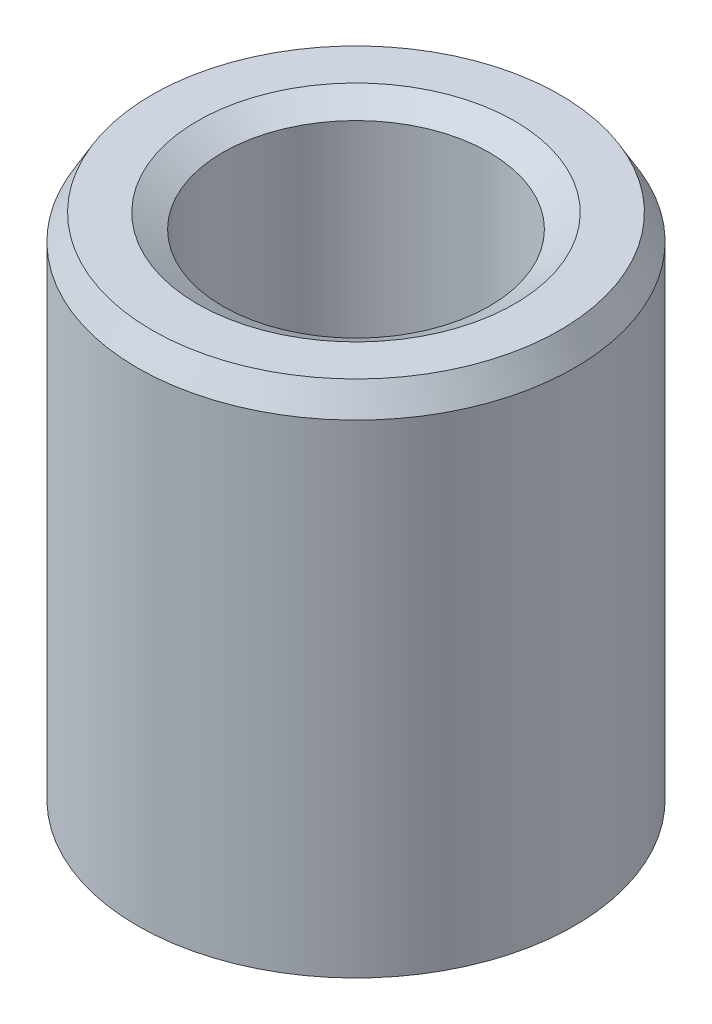
ISO-10303-21;
HEADER;
FILE_DESCRIPTION(('STEP AP214'),'2;1');
FILE_NAME('part.step','',(''),(''),'','','');
FILE_SCHEMA(('AUTOMOTIVE_DESIGN { 1 0 10303 214 1 1 1 1 }'));
ENDSEC;
DATA;
#1=APPLICATION_CONTEXT('core data for automotive mechanical design processes');
#2=APPLICATION_PROTOCOL_DEFINITION('international standard','automotive_design',2000,#1);
#3=PRODUCT_CONTEXT('',#1,'mechanical');
#4=PRODUCT('Part','Part','',(#3));
#5=PRODUCT_RELATED_PRODUCT_CATEGORY('part','',(#4));
#6=PRODUCT_DEFINITION_FORMATION('','',#4);
#7=PRODUCT_DEFINITION_CONTEXT('part definition',#1,'design');
#8=PRODUCT_DEFINITION('design','',#6,#7);
#9=PRODUCT_DEFINITION_SHAPE('','',#8);
#10=(LENGTH_UNIT() NAMED_UNIT(*) SI_UNIT(.MILLI.,.METRE.));
#11=(NAMED_UNIT(*) PLANE_ANGLE_UNIT() SI_UNIT($,.RADIAN.));
#12=(NAMED_UNIT(*) SI_UNIT($,.STERADIAN.) SOLID_ANGLE_UNIT());
#13=UNCERTAINTY_MEASURE_WITH_UNIT(LENGTH_MEASURE(1.E-05),#10,'distance_accuracy_value','');
#14=(GEOMETRIC_REPRESENTATION_CONTEXT(3) GLOBAL_UNCERTAINTY_ASSIGNED_CONTEXT((#13)) GLOBAL_UNIT_ASSIGNED_CONTEXT((#10,
#11,#12)) REPRESENTATION_CONTEXT('',''));
#15=CARTESIAN_POINT('',(0.,0.,0.));
#16=DIRECTION('',(0.,0.,1.));
#17=DIRECTION('',(1.,0.,0.));
#18=AXIS2_PLACEMENT_3D('',#15,#16,#17);
#19=CARTESIAN_POINT('',(0.,35.8932603499428,0.));
#20=DIRECTION('',(0.,-1.,0.));
#21=DIRECTION('',(0.,0.,-1.));
#22=AXIS2_PLACEMENT_3D('',#19,#20,#21);
#23=CYLINDRICAL_SURFACE('',#22,15.);
#24=CARTESIAN_POINT('',(0.,1.00289537480831,0.));
#25=DIRECTION('',(0.,1.,0.));
#26=DIRECTION('',(0.,0.,1.));
#27=AXIS2_PLACEMENT_3D('',#24,#25,#26);
#28=CIRCLE('',#27,15.);
#29=CARTESIAN_POINT('',(0.,1.00289537480831,15.));
#30=VERTEX_POINT('',#29);
#31=EDGE_CURVE('E10',#30,#30,#28,.T.);
#32=ORIENTED_EDGE('',*,*,#31,.T.);
#33=EDGE_LOOP('',(#32));
#34=FACE_BOUND('',#33,.T.);
#35=CARTESIAN_POINT('',(0.,34.156194606099,0.));
#36=DIRECTION('',(0.,1.,0.));
#37=DIRECTION('',(0.,0.,1.));
#38=AXIS2_PLACEMENT_3D('',#35,#36,#37);
#39=CIRCLE('',#38,15.);
#40=CARTESIAN_POINT('',(0.,34.156194606099,15.));
#41=VERTEX_POINT('',#40);
#42=EDGE_CURVE('E50',#41,#41,#39,.F.);
#43=ORIENTED_EDGE('',*,*,#42,.T.);
#44=EDGE_LOOP('',(#43));
#45=FACE_BOUND('',#44,.T.);
#46=ADVANCED_FACE('F39',(#34,#45),#23,.T.);
#47=CARTESIAN_POINT('',(0.,35.8932603499428,0.));
#48=DIRECTION('',(0.,1.,0.));
#49=DIRECTION('',(0.,0.,1.));
#50=AXIS2_PLACEMENT_3D('',#47,#48,#49);
#51=PLANE('',#50);
#52=CARTESIAN_POINT('',(0.,35.8932603499428,0.));
#53=DIRECTION('',(0.,1.,0.));
#54=DIRECTION('',(0.,0.,1.));
#55=AXIS2_PLACEMENT_3D('',#52,#53,#54);
#56=CIRCLE('',#55,10.8814380931785);
#57=CARTESIAN_POINT('',(0.,35.8932603499428,10.8814380931785));
#58=VERTEX_POINT('',#57);
#59=EDGE_CURVE('E58',#58,#58,#56,.F.);
#60=ORIENTED_EDGE('',*,*,#59,.T.);
#61=EDGE_LOOP('',(#60));
#62=FACE_BOUND('',#61,.T.);
#63=CARTESIAN_POINT('',(0.,35.8932603499428,0.));
#64=DIRECTION('',(0.,1.,0.));
#65=DIRECTION('',(0.,0.,1.));
#66=AXIS2_PLACEMENT_3D('',#63,#64,#65);
#67=CIRCLE('',#66,13.9971046251917);
#68=CARTESIAN_POINT('',(0.,35.8932603499428,13.9971046251917));
#69=VERTEX_POINT('',#68);
#70=EDGE_CURVE('E61',#69,#69,#67,.T.);
#71=ORIENTED_EDGE('',*,*,#70,.T.);
#72=EDGE_LOOP('',(#71));
#73=FACE_BOUND('',#72,.T.);
#74=ADVANCED_FACE('F88',(#62,#73),#51,.T.);
#75=CARTESIAN_POINT('',(0.,0.,0.));
#76=DIRECTION('',(0.,1.,0.));
#77=DIRECTION('',(0.,0.,1.));
#78=AXIS2_PLACEMENT_3D('',#75,#76,#77);
#79=PLANE('',#78);
#80=CARTESIAN_POINT('',(0.,0.,0.));
#81=DIRECTION('',(0.,1.,0.));
#82=DIRECTION('',(0.,0.,1.));
#83=AXIS2_PLACEMENT_3D('',#80,#81,#82);
#84=CIRCLE('',#83,10.147267724143);
#85=CARTESIAN_POINT('',(0.,0.,10.147267724143));
#86=VERTEX_POINT('',#85);
#87=EDGE_CURVE('E51',#86,#86,#84,.T.);
#88=ORIENTED_EDGE('',*,*,#87,.T.);
#89=EDGE_LOOP('',(#88));
#90=FACE_BOUND('',#89,.T.);
#91=CARTESIAN_POINT('',(0.,0.,0.));
#92=DIRECTION('',(0.,1.,0.));
#93=DIRECTION('',(0.,0.,1.));
#94=AXIS2_PLACEMENT_3D('',#91,#92,#93);
#95=CIRCLE('',#94,13.2629342561562);
#96=CARTESIAN_POINT('',(0.,0.,13.2629342561562));
#97=VERTEX_POINT('',#96);
#98=EDGE_CURVE('E54',#97,#97,#95,.F.);
#99=ORIENTED_EDGE('',*,*,#98,.T.);
#100=EDGE_LOOP('',(#99));
#101=FACE_BOUND('',#100,.T.);
#102=ADVANCED_FACE('F83',(#90,#101),#79,.F.);
#103=CARTESIAN_POINT('',(0.,35.8932603499428,0.));
#104=DIRECTION('',(0.,-1.,0.));
#105=DIRECTION('',(0.,0.,-1.));
#106=AXIS2_PLACEMENT_3D('',#103,#104,#105);
#107=CYLINDRICAL_SURFACE('',#106,9.14437234933465);
#108=CARTESIAN_POINT('',(0.,34.8903649751345,0.));
#109=DIRECTION('',(0.,1.,0.));
#110=DIRECTION('',(0.,0.,1.));
#111=AXIS2_PLACEMENT_3D('',#108,#109,#110);
#112=CIRCLE('',#111,9.14437234933465);
#113=CARTESIAN_POINT('',(0.,34.8903649751345,9.14437234933465));
#114=VERTEX_POINT('',#113);
#115=EDGE_CURVE('E67',#114,#114,#112,.T.);
#116=ORIENTED_EDGE('',*,*,#115,.T.);
#117=EDGE_LOOP('',(#116));
#118=FACE_BOUND('',#117,.T.);
#119=CARTESIAN_POINT('',(0.,1.73706574384383,0.));
#120=DIRECTION('',(0.,1.,0.));
#121=DIRECTION('',(0.,0.,1.));
#122=AXIS2_PLACEMENT_3D('',#119,#120,#121);
#123=CIRCLE('',#122,9.14437234933465);
#124=CARTESIAN_POINT('',(0.,1.73706574384383,9.14437234933465));
#125=VERTEX_POINT('',#124);
#126=EDGE_CURVE('E69',#125,#125,#123,.F.);
#127=ORIENTED_EDGE('',*,*,#126,.T.);
#128=EDGE_LOOP('',(#127));
#129=FACE_BOUND('',#128,.T.);
#130=ADVANCED_FACE('F71',(#118,#129),#107,.F.);
#131=CARTESIAN_POINT('',(0.,34.8903649751345,0.));
#132=DIRECTION('',(0.,1.,0.));
#133=DIRECTION('',(0.,0.,1.));
#134=AXIS2_PLACEMENT_3D('',#131,#132,#133);
#135=CONICAL_SURFACE('',#134,9.14437234933465,1.0471975511966);
#136=ORIENTED_EDGE('',*,*,#59,.F.);
#137=EDGE_LOOP('',(#136));
#138=FACE_BOUND('',#137,.T.);
#139=ORIENTED_EDGE('',*,*,#115,.F.);
#140=EDGE_LOOP('',(#139));
#141=FACE_BOUND('',#140,.T.);
#142=ADVANCED_FACE('F77',(#138,#141),#135,.F.);
#143=CARTESIAN_POINT('',(0.,0.,0.));
#144=DIRECTION('',(0.,-1.,0.));
#145=DIRECTION('',(0.,0.,-1.));
#146=AXIS2_PLACEMENT_3D('',#143,#144,#145);
#147=CONICAL_SURFACE('',#146,10.147267724143,0.523598775598295);
#148=ORIENTED_EDGE('',*,*,#126,.F.);
#149=EDGE_LOOP('',(#148));
#150=FACE_BOUND('',#149,.T.);
#151=ORIENTED_EDGE('',*,*,#87,.F.);
#152=EDGE_LOOP('',(#151));
#153=FACE_BOUND('',#152,.T.);
#154=ADVANCED_FACE('F73',(#150,#153),#147,.F.);
#155=CARTESIAN_POINT('',(0.,1.00289537480831,0.));
#156=DIRECTION('',(0.,1.,0.));
#157=DIRECTION('',(0.,0.,1.));
#158=AXIS2_PLACEMENT_3D('',#155,#156,#157);
#159=CONICAL_SURFACE('',#158,15.,1.0471975511966);
#160=ORIENTED_EDGE('',*,*,#98,.F.);
#161=EDGE_LOOP('',(#160));
#162=FACE_BOUND('',#161,.T.);
#163=ORIENTED_EDGE('',*,*,#31,.F.);
#164=EDGE_LOOP('',(#163));
#165=FACE_BOUND('',#164,.T.);
#166=ADVANCED_FACE('F76',(#162,#165),#159,.T.);
#167=CARTESIAN_POINT('',(0.,35.8932603499428,0.));
#168=DIRECTION('',(0.,-1.,0.));
#169=DIRECTION('',(0.,0.,-1.));
#170=AXIS2_PLACEMENT_3D('',#167,#168,#169);
#171=CONICAL_SURFACE('',#170,13.9971046251917,0.523598775598296);
#172=ORIENTED_EDGE('',*,*,#42,.F.);
#173=EDGE_LOOP('',(#172));
#174=FACE_BOUND('',#173,.T.);
#175=ORIENTED_EDGE('',*,*,#70,.F.);
#176=EDGE_LOOP('',(#175));
#177=FACE_BOUND('',#176,.T.);
#178=ADVANCED_FACE('F45',(#174,#177),#171,.T.);
#179=CLOSED_SHELL('',(#46,#74,#102,#130,#142,#154,#166,#178));
#180=MANIFOLD_SOLID_BREP('B2',#179);
#181=ADVANCED_BREP_SHAPE_REPRESENTATION('',(#18,#180),#14);
#182=SHAPE_DEFINITION_REPRESENTATION(#9,#181);
ENDSEC;
END-ISO-10303-21;
